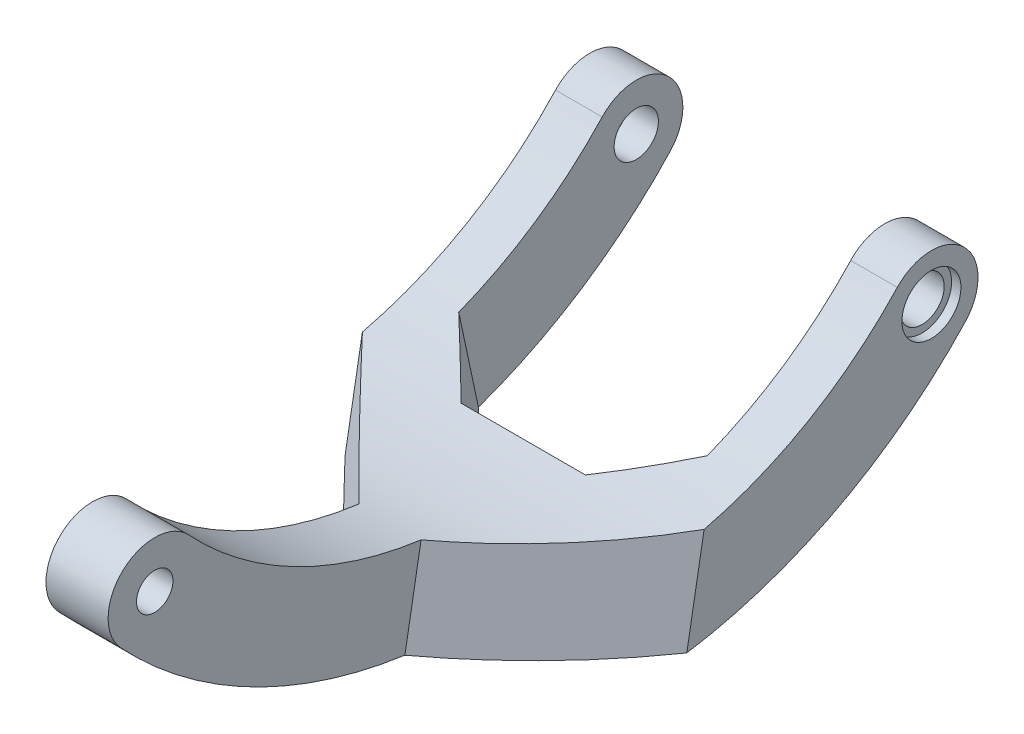
ISO-10303-21;
HEADER;
FILE_DESCRIPTION(('STEP AP214'),'2;1');
FILE_NAME('part.step','',(''),(''),'','','');
FILE_SCHEMA(('AUTOMOTIVE_DESIGN { 1 0 10303 214 1 1 1 1 }'));
ENDSEC;
DATA;
#1=APPLICATION_CONTEXT('core data for automotive mechanical design processes');
#2=APPLICATION_PROTOCOL_DEFINITION('international standard','automotive_design',2000,#1);
#3=PRODUCT_CONTEXT('',#1,'mechanical');
#4=PRODUCT('Part','Part','',(#3));
#5=PRODUCT_RELATED_PRODUCT_CATEGORY('part','',(#4));
#6=PRODUCT_DEFINITION_FORMATION('','',#4);
#7=PRODUCT_DEFINITION_CONTEXT('part definition',#1,'design');
#8=PRODUCT_DEFINITION('design','',#6,#7);
#9=PRODUCT_DEFINITION_SHAPE('','',#8);
#10=(LENGTH_UNIT() NAMED_UNIT(*) SI_UNIT(.MILLI.,.METRE.));
#11=(NAMED_UNIT(*) PLANE_ANGLE_UNIT() SI_UNIT($,.RADIAN.));
#12=(NAMED_UNIT(*) SI_UNIT($,.STERADIAN.) SOLID_ANGLE_UNIT());
#13=UNCERTAINTY_MEASURE_WITH_UNIT(LENGTH_MEASURE(1.E-05),#10,'distance_accuracy_value','');
#14=(GEOMETRIC_REPRESENTATION_CONTEXT(3) GLOBAL_UNCERTAINTY_ASSIGNED_CONTEXT((#13)) GLOBAL_UNIT_ASSIGNED_CONTEXT((#10,
#11,#12)) REPRESENTATION_CONTEXT('',''));
#15=CARTESIAN_POINT('',(0.,0.,0.));
#16=DIRECTION('',(0.,0.,1.));
#17=DIRECTION('',(1.,0.,0.));
#18=AXIS2_PLACEMENT_3D('',#15,#16,#17);
#19=CARTESIAN_POINT('',(11.,0.,-20.5));
#20=DIRECTION('',(-1.,0.,0.));
#21=DIRECTION('',(0.,0.,-1.));
#22=AXIS2_PLACEMENT_3D('',#19,#20,#21);
#23=CYLINDRICAL_SURFACE('',#22,1.425);
#24=CARTESIAN_POINT('',(-8.,0.,-20.5));
#25=DIRECTION('',(-1.,0.,0.));
#26=DIRECTION('',(0.,0.,1.));
#27=AXIS2_PLACEMENT_3D('',#24,#25,#26);
#28=CIRCLE('',#27,1.425);
#29=CARTESIAN_POINT('',(-8.,0.,-19.075));
#30=VERTEX_POINT('',#29);
#31=EDGE_CURVE('E292',#30,#30,#28,.F.);
#32=ORIENTED_EDGE('',*,*,#31,.T.);
#33=EDGE_LOOP('',(#32));
#34=FACE_BOUND('',#33,.T.);
#35=CARTESIAN_POINT('',(-10.,0.,-20.5));
#36=DIRECTION('',(1.,0.,0.));
#37=DIRECTION('',(0.,0.,-1.));
#38=AXIS2_PLACEMENT_3D('',#35,#36,#37);
#39=CIRCLE('',#38,1.425);
#40=CARTESIAN_POINT('',(-10.,0.,-21.925));
#41=VERTEX_POINT('',#40);
#42=EDGE_CURVE('E201',#41,#41,#39,.T.);
#43=ORIENTED_EDGE('',*,*,#42,.F.);
#44=EDGE_LOOP('',(#43));
#45=FACE_BOUND('',#44,.T.);
#46=ADVANCED_FACE('F45',(#34,#45),#23,.F.);
#47=CARTESIAN_POINT('',(11.,19.0722311227607,0.));
#48=DIRECTION('',(-1.,0.,0.));
#49=DIRECTION('',(0.,0.,-1.));
#50=AXIS2_PLACEMENT_3D('',#47,#48,#49);
#51=CYLINDRICAL_SURFACE('',#50,25.);
#52=CARTESIAN_POINT('',(-2.,19.0722311227607,0.));
#53=DIRECTION('',(-1.,0.,0.));
#54=DIRECTION('',(0.,0.,1.));
#55=AXIS2_PLACEMENT_3D('',#52,#53,#54);
#56=CIRCLE('',#55,25.);
#57=CARTESIAN_POINT('',(-2.,2.04345333458149,18.3035714285714));
#58=VERTEX_POINT('',#57);
#59=CARTESIAN_POINT('',(-2.,-5.70190684038016,3.35292233480958));
#60=VERTEX_POINT('',#59);
#61=EDGE_CURVE('E155',#58,#60,#56,.F.);
#62=ORIENTED_EDGE('',*,*,#61,.F.);
#63=DIRECTION('',(-1.,0.,0.));
#64=VECTOR('',#63,1.);
#65=CARTESIAN_POINT('',(11.,2.04345333458149,18.3035714285714));
#66=LINE('',#65,#64);
#67=CARTESIAN_POINT('',(2.,2.04345333458149,18.3035714285714));
#68=VERTEX_POINT('',#67);
#69=EDGE_CURVE('E151',#68,#58,#66,.T.);
#70=ORIENTED_EDGE('',*,*,#69,.F.);
#71=CARTESIAN_POINT('',(2.,19.0722311227607,0.));
#72=DIRECTION('',(-1.,0.,0.));
#73=DIRECTION('',(0.,0.,1.));
#74=AXIS2_PLACEMENT_3D('',#71,#72,#73);
#75=CIRCLE('',#74,25.);
#76=CARTESIAN_POINT('',(2.,-5.70190684038017,3.3529223348095));
#77=VERTEX_POINT('',#76);
#78=EDGE_CURVE('E315',#77,#68,#75,.T.);
#79=ORIENTED_EDGE('',*,*,#78,.F.);
#80=CARTESIAN_POINT('',(0.999999999999822,19.0722311227607,0.));
#81=DIRECTION('',(-0.707106781186544,-0.122787803968969,-0.696364240320023));
#82=DIRECTION('',(-0.707106781186551,0.122787803968968,0.696364240320016));
#83=AXIS2_PLACEMENT_3D('',#80,#81,#82);
#84=ELLIPSE('',#83,35.3553390593276,25.);
#85=CARTESIAN_POINT('',(11.,-5.22903101969769,-5.86929793787307));
#86=VERTEX_POINT('',#85);
#87=EDGE_CURVE('E211',#86,#77,#84,.T.);
#88=ORIENTED_EDGE('',*,*,#87,.F.);
#89=CARTESIAN_POINT('',(11.,19.0722311227607,0.));
#90=DIRECTION('',(-1.,0.,0.));
#91=DIRECTION('',(0.,0.,1.));
#92=AXIS2_PLACEMENT_3D('',#89,#90,#91);
#93=CIRCLE('',#92,25.);
#94=CARTESIAN_POINT('',(11.,2.0434533345815,-18.3035714285714));
#95=VERTEX_POINT('',#94);
#96=EDGE_CURVE('E257',#95,#86,#93,.T.);
#97=ORIENTED_EDGE('',*,*,#96,.F.);
#98=DIRECTION('',(-1.,0.,0.));
#99=VECTOR('',#98,1.);
#100=CARTESIAN_POINT('',(11.,2.0434533345815,-18.3035714285714));
#101=LINE('',#100,#99);
#102=CARTESIAN_POINT('',(8.,2.0434533345815,-18.3035714285714));
#103=VERTEX_POINT('',#102);
#104=EDGE_CURVE('E183',#95,#103,#101,.T.);
#105=ORIENTED_EDGE('',*,*,#104,.T.);
#106=CARTESIAN_POINT('',(8.,19.0722311227607,0.));
#107=DIRECTION('',(-1.,0.,0.));
#108=DIRECTION('',(0.,0.,1.));
#109=AXIS2_PLACEMENT_3D('',#106,#107,#108);
#110=CIRCLE('',#109,25.);
#111=CARTESIAN_POINT('',(8.,-4.22428912871639,-9.07039933919781));
#112=VERTEX_POINT('',#111);
#113=EDGE_CURVE('E239',#103,#112,#110,.T.);
#114=ORIENTED_EDGE('',*,*,#113,.T.);
#115=CARTESIAN_POINT('',(3.99999999999997,19.0722311227607,0.));
#116=DIRECTION('',(-0.707106781186544,0.147816494294591,-0.691484116964708));
#117=DIRECTION('',(-0.707106781186551,-0.147816494294589,0.691484116964701));
#118=AXIS2_PLACEMENT_3D('',#115,#116,#117);
#119=ELLIPSE('',#118,35.3553390593276,25.);
#120=CARTESIAN_POINT('',(3.99999999999997,-5.37542428666607,-5.22610227434636));
#121=VERTEX_POINT('',#120);
#122=EDGE_CURVE('E53',#121,#112,#119,.F.);
#123=ORIENTED_EDGE('',*,*,#122,.F.);
#124=DIRECTION('',(-1.,0.,0.));
#125=VECTOR('',#124,1.);
#126=CARTESIAN_POINT('',(34.168824834572,-5.37542428666607,-5.22610227434636));
#127=LINE('',#126,#125);
#128=CARTESIAN_POINT('',(-3.99999999999997,-5.37542428666607,-5.22610227434636));
#129=VERTEX_POINT('',#128);
#130=EDGE_CURVE('E243',#121,#129,#127,.T.);
#131=ORIENTED_EDGE('',*,*,#130,.T.);
#132=CARTESIAN_POINT('',(-3.99999999999997,19.0722311227607,0.));
#133=DIRECTION('',(-0.707106781186544,-0.147816494294591,0.691484116964709));
#134=DIRECTION('',(-0.707106781186551,0.147816494294589,-0.691484116964701));
#135=AXIS2_PLACEMENT_3D('',#132,#133,#134);
#136=ELLIPSE('',#135,35.3553390593276,25.);
#137=CARTESIAN_POINT('',(-8.,-4.22428912871639,-9.07039933919781));
#138=VERTEX_POINT('',#137);
#139=EDGE_CURVE('E232',#138,#129,#136,.T.);
#140=ORIENTED_EDGE('',*,*,#139,.F.);
#141=CARTESIAN_POINT('',(-8.,19.0722311227607,0.));
#142=DIRECTION('',(-1.,0.,0.));
#143=DIRECTION('',(0.,0.,1.));
#144=AXIS2_PLACEMENT_3D('',#141,#142,#143);
#145=CIRCLE('',#144,25.);
#146=CARTESIAN_POINT('',(-8.,2.0434533345815,-18.3035714285714));
#147=VERTEX_POINT('',#146);
#148=EDGE_CURVE('E284',#138,#147,#145,.F.);
#149=ORIENTED_EDGE('',*,*,#148,.T.);
#150=CARTESIAN_POINT('',(-11.,2.0434533345815,-18.3035714285714));
#151=VERTEX_POINT('',#150);
#152=EDGE_CURVE('E182',#147,#151,#101,.T.);
#153=ORIENTED_EDGE('',*,*,#152,.T.);
#154=CARTESIAN_POINT('',(-11.,19.0722311227607,0.));
#155=DIRECTION('',(-1.,0.,0.));
#156=DIRECTION('',(0.,0.,1.));
#157=AXIS2_PLACEMENT_3D('',#154,#155,#156);
#158=CIRCLE('',#157,25.);
#159=CARTESIAN_POINT('',(-11.,-5.22903101969766,-5.86929793787319));
#160=VERTEX_POINT('',#159);
#161=EDGE_CURVE('E265',#151,#160,#158,.T.);
#162=ORIENTED_EDGE('',*,*,#161,.T.);
#163=CARTESIAN_POINT('',(-0.999999999999926,19.0722311227607,0.));
#164=DIRECTION('',(0.707106781186551,-0.122787803968968,-0.696364240320016));
#165=DIRECTION('',(-0.707106781186544,-0.122787803968969,-0.696364240320023));
#166=AXIS2_PLACEMENT_3D('',#163,#164,#165);
#167=ELLIPSE('',#166,35.3553390593272,25.);
#168=EDGE_CURVE('E214',#60,#160,#167,.T.);
#169=ORIENTED_EDGE('',*,*,#168,.F.);
#170=EDGE_LOOP('',(#62,#70,#79,#88,#97,#105,#114,#123,#131,#140,#149,#153,#162,#169));
#171=FACE_BOUND('',#170,.T.);
#172=ADVANCED_FACE('F240',(#171),#51,.F.);
#173=CARTESIAN_POINT('',(11.,19.0722311227607,0.));
#174=DIRECTION('',(-1.,0.,0.));
#175=DIRECTION('',(0.,0.,-1.));
#176=AXIS2_PLACEMENT_3D('',#173,#174,#175);
#177=CYLINDRICAL_SURFACE('',#176,31.);
#178=CARTESIAN_POINT('',(-0.999999999999926,19.0722311227607,0.));
#179=DIRECTION('',(0.707106781186551,-0.122787803968968,-0.696364240320016));
#180=DIRECTION('',(-0.707106781186544,-0.122787803968969,-0.696364240320023));
#181=AXIS2_PLACEMENT_3D('',#178,#179,#180);
#182=ELLIPSE('',#181,43.8406204335657,31.);
#183=CARTESIAN_POINT('',(-11.,-11.5612690684152,-4.75275352161561));
#184=VERTEX_POINT('',#183);
#185=CARTESIAN_POINT('',(-2.,-11.6145692679641,4.39548424861381));
#186=VERTEX_POINT('',#185);
#187=EDGE_CURVE('E209',#184,#186,#182,.F.);
#188=ORIENTED_EDGE('',*,*,#187,.F.);
#189=CARTESIAN_POINT('',(-11.,19.0722311227607,0.));
#190=DIRECTION('',(-1.,0.,0.));
#191=DIRECTION('',(0.,0.,1.));
#192=AXIS2_PLACEMENT_3D('',#189,#190,#191);
#193=CIRCLE('',#192,31.);
#194=CARTESIAN_POINT('',(-11.,-2.04345333458148,-22.6964285714286));
#195=VERTEX_POINT('',#194);
#196=EDGE_CURVE('E261',#195,#184,#193,.T.);
#197=ORIENTED_EDGE('',*,*,#196,.F.);
#198=DIRECTION('',(-1.,0.,0.));
#199=VECTOR('',#198,1.);
#200=CARTESIAN_POINT('',(11.,-2.04345333458148,-22.6964285714286));
#201=LINE('',#200,#199);
#202=CARTESIAN_POINT('',(-8.,-2.04345333458148,-22.6964285714286));
#203=VERTEX_POINT('',#202);
#204=EDGE_CURVE('E172',#203,#195,#201,.T.);
#205=ORIENTED_EDGE('',*,*,#204,.F.);
#206=CARTESIAN_POINT('',(-8.,19.0722311227607,0.));
#207=DIRECTION('',(-1.,0.,0.));
#208=DIRECTION('',(0.,0.,1.));
#209=AXIS2_PLACEMENT_3D('',#206,#207,#208);
#210=CIRCLE('',#209,31.);
#211=CARTESIAN_POINT('',(-8.,-10.1532630721689,-10.3378183898799));
#212=VERTEX_POINT('',#211);
#213=EDGE_CURVE('E248',#212,#203,#210,.F.);
#214=ORIENTED_EDGE('',*,*,#213,.F.);
#215=CARTESIAN_POINT('',(-3.99999999999997,19.0722311227607,0.));
#216=DIRECTION('',(-0.707106781186544,-0.147816494294591,0.691484116964709));
#217=DIRECTION('',(-0.707106781186551,0.147816494294589,-0.691484116964701));
#218=AXIS2_PLACEMENT_3D('',#215,#216,#217);
#219=ELLIPSE('',#218,43.8406204335662,31.);
#220=CARTESIAN_POINT('',(-3.99999999999997,-11.2428615849285,-6.48036682018948));
#221=VERTEX_POINT('',#220);
#222=EDGE_CURVE('E229',#221,#212,#219,.F.);
#223=ORIENTED_EDGE('',*,*,#222,.F.);
#224=DIRECTION('',(-1.,0.,0.));
#225=VECTOR('',#224,1.);
#226=CARTESIAN_POINT('',(34.168824834572,-11.2428615849285,-6.48036682018948));
#227=LINE('',#226,#225);
#228=CARTESIAN_POINT('',(3.99999999999997,-11.2428615849285,-6.48036682018948));
#229=VERTEX_POINT('',#228);
#230=EDGE_CURVE('E254',#229,#221,#227,.T.);
#231=ORIENTED_EDGE('',*,*,#230,.F.);
#232=CARTESIAN_POINT('',(3.99999999999997,19.0722311227607,0.));
#233=DIRECTION('',(-0.707106781186544,0.147816494294591,-0.691484116964708));
#234=DIRECTION('',(-0.707106781186551,-0.147816494294589,0.691484116964701));
#235=AXIS2_PLACEMENT_3D('',#232,#233,#234);
#236=ELLIPSE('',#235,43.8406204335662,31.);
#237=CARTESIAN_POINT('',(8.,-10.1532630721689,-10.3378183898799));
#238=VERTEX_POINT('',#237);
#239=EDGE_CURVE('E12',#238,#229,#236,.T.);
#240=ORIENTED_EDGE('',*,*,#239,.F.);
#241=CARTESIAN_POINT('',(8.,19.0722311227607,0.));
#242=DIRECTION('',(-1.,0.,0.));
#243=DIRECTION('',(0.,0.,1.));
#244=AXIS2_PLACEMENT_3D('',#241,#242,#243);
#245=CIRCLE('',#244,31.);
#246=CARTESIAN_POINT('',(8.,-2.04345333458148,-22.6964285714286));
#247=VERTEX_POINT('',#246);
#248=EDGE_CURVE('E269',#247,#238,#245,.T.);
#249=ORIENTED_EDGE('',*,*,#248,.F.);
#250=CARTESIAN_POINT('',(11.,-2.04345333458148,-22.6964285714286));
#251=VERTEX_POINT('',#250);
#252=EDGE_CURVE('E175',#251,#247,#201,.T.);
#253=ORIENTED_EDGE('',*,*,#252,.F.);
#254=CARTESIAN_POINT('',(11.,19.0722311227607,0.));
#255=DIRECTION('',(-1.,0.,0.));
#256=DIRECTION('',(0.,0.,1.));
#257=AXIS2_PLACEMENT_3D('',#254,#255,#256);
#258=CIRCLE('',#257,31.);
#259=CARTESIAN_POINT('',(11.,-11.5612690684152,-4.7527535216155));
#260=VERTEX_POINT('',#259);
#261=EDGE_CURVE('E177',#251,#260,#258,.T.);
#262=ORIENTED_EDGE('',*,*,#261,.T.);
#263=CARTESIAN_POINT('',(0.999999999999822,19.0722311227607,0.));
#264=DIRECTION('',(-0.707106781186544,-0.122787803968969,-0.696364240320023));
#265=DIRECTION('',(-0.707106781186551,0.122787803968968,0.696364240320016));
#266=AXIS2_PLACEMENT_3D('',#263,#264,#265);
#267=ELLIPSE('',#266,43.8406204335662,31.);
#268=CARTESIAN_POINT('',(2.,-11.6145692679642,4.39548424861372));
#269=VERTEX_POINT('',#268);
#270=EDGE_CURVE('E206',#269,#260,#267,.F.);
#271=ORIENTED_EDGE('',*,*,#270,.F.);
#272=CARTESIAN_POINT('',(2.,19.0722311227607,0.));
#273=DIRECTION('',(-1.,0.,0.));
#274=DIRECTION('',(0.,0.,1.));
#275=AXIS2_PLACEMENT_3D('',#272,#273,#274);
#276=CIRCLE('',#275,31.);
#277=CARTESIAN_POINT('',(2.,-2.0434533345815,22.6964285714286));
#278=VERTEX_POINT('',#277);
#279=EDGE_CURVE('E171',#278,#269,#276,.F.);
#280=ORIENTED_EDGE('',*,*,#279,.F.);
#281=DIRECTION('',(-1.,0.,0.));
#282=VECTOR('',#281,1.);
#283=CARTESIAN_POINT('',(11.,-2.0434533345815,22.6964285714286));
#284=LINE('',#283,#282);
#285=CARTESIAN_POINT('',(-2.,-2.0434533345815,22.6964285714286));
#286=VERTEX_POINT('',#285);
#287=EDGE_CURVE('E148',#278,#286,#284,.T.);
#288=ORIENTED_EDGE('',*,*,#287,.T.);
#289=CARTESIAN_POINT('',(-2.,19.0722311227607,0.));
#290=DIRECTION('',(-1.,0.,0.));
#291=DIRECTION('',(0.,0.,1.));
#292=AXIS2_PLACEMENT_3D('',#289,#290,#291);
#293=CIRCLE('',#292,31.);
#294=EDGE_CURVE('E159',#186,#286,#293,.T.);
#295=ORIENTED_EDGE('',*,*,#294,.F.);
#296=EDGE_LOOP('',(#188,#197,#205,#214,#223,#231,#240,#249,#253,#262,#271,#280,#288,#295));
#297=FACE_BOUND('',#296,.T.);
#298=ADVANCED_FACE('F168',(#297),#177,.T.);
#299=CARTESIAN_POINT('',(-11.,0.,0.));
#300=DIRECTION('',(1.,0.,0.));
#301=DIRECTION('',(0.,0.,1.));
#302=AXIS2_PLACEMENT_3D('',#299,#300,#301);
#303=PLANE('',#302);
#304=CARTESIAN_POINT('',(-11.,0.,-20.5));
#305=DIRECTION('',(-1.,0.,0.));
#306=DIRECTION('',(0.,0.,1.));
#307=AXIS2_PLACEMENT_3D('',#304,#305,#306);
#308=CIRCLE('',#307,1.9);
#309=CARTESIAN_POINT('',(-11.,0.,-18.6));
#310=VERTEX_POINT('',#309);
#311=EDGE_CURVE('E156',#310,#310,#308,.T.);
#312=ORIENTED_EDGE('',*,*,#311,.F.);
#313=EDGE_LOOP('',(#312));
#314=FACE_BOUND('',#313,.T.);
#315=ORIENTED_EDGE('',*,*,#161,.F.);
#316=CARTESIAN_POINT('',(-11.,0.,-20.5));
#317=DIRECTION('',(-1.,0.,0.));
#318=DIRECTION('',(0.,0.,1.));
#319=AXIS2_PLACEMENT_3D('',#316,#317,#318);
#320=CIRCLE('',#319,3.);
#321=EDGE_CURVE('E268',#151,#195,#320,.T.);
#322=ORIENTED_EDGE('',*,*,#321,.T.);
#323=ORIENTED_EDGE('',*,*,#196,.T.);
#324=DIRECTION('',(0.,-0.984807753012209,0.173648177666924));
#325=VECTOR('',#324,1.);
#326=CARTESIAN_POINT('',(-11.,-13.1932909972871,-4.46498402244763));
#327=LINE('',#326,#325);
#328=EDGE_CURVE('E186',#160,#184,#327,.T.);
#329=ORIENTED_EDGE('',*,*,#328,.F.);
#330=EDGE_LOOP('',(#315,#322,#323,#329));
#331=FACE_BOUND('',#330,.T.);
#332=ADVANCED_FACE('F274',(#314,#331),#303,.F.);
#333=CARTESIAN_POINT('',(8.,0.,-20.5));
#334=DIRECTION('',(-1.,0.,0.));
#335=DIRECTION('',(0.,0.,1.));
#336=AXIS2_PLACEMENT_3D('',#333,#334,#335);
#337=CIRCLE('',#336,1.425);
#338=CARTESIAN_POINT('',(8.,0.,-19.075));
#339=VERTEX_POINT('',#338);
#340=EDGE_CURVE('E246',#339,#339,#337,.T.);
#341=ORIENTED_EDGE('',*,*,#340,.T.);
#342=EDGE_LOOP('',(#341));
#343=FACE_BOUND('',#342,.T.);
#344=CARTESIAN_POINT('',(10.4,0.,-20.5));
#345=DIRECTION('',(-1.,0.,0.));
#346=DIRECTION('',(0.,0.,1.));
#347=AXIS2_PLACEMENT_3D('',#344,#345,#346);
#348=CIRCLE('',#347,1.425);
#349=CARTESIAN_POINT('',(10.4,0.,-19.075));
#350=VERTEX_POINT('',#349);
#351=EDGE_CURVE('E190',#350,#350,#348,.T.);
#352=ORIENTED_EDGE('',*,*,#351,.F.);
#353=EDGE_LOOP('',(#352));
#354=FACE_BOUND('',#353,.T.);
#355=ADVANCED_FACE('F350',(#343,#354),#23,.F.);
#356=CARTESIAN_POINT('',(11.,0.,20.5));
#357=DIRECTION('',(-1.,0.,0.));
#358=DIRECTION('',(0.,0.,-1.));
#359=AXIS2_PLACEMENT_3D('',#356,#357,#358);
#360=CYLINDRICAL_SURFACE('',#359,3.);
#361=ORIENTED_EDGE('',*,*,#287,.F.);
#362=CARTESIAN_POINT('',(2.,0.,20.5));
#363=DIRECTION('',(-1.,0.,0.));
#364=DIRECTION('',(0.,0.,1.));
#365=AXIS2_PLACEMENT_3D('',#362,#363,#364);
#366=CIRCLE('',#365,3.);
#367=EDGE_CURVE('E312',#68,#278,#366,.F.);
#368=ORIENTED_EDGE('',*,*,#367,.F.);
#369=ORIENTED_EDGE('',*,*,#69,.T.);
#370=CARTESIAN_POINT('',(-2.,0.,20.5));
#371=DIRECTION('',(-1.,0.,0.));
#372=DIRECTION('',(0.,0.,1.));
#373=AXIS2_PLACEMENT_3D('',#370,#371,#372);
#374=CIRCLE('',#373,3.);
#375=EDGE_CURVE('E144',#286,#58,#374,.T.);
#376=ORIENTED_EDGE('',*,*,#375,.F.);
#377=EDGE_LOOP('',(#361,#368,#369,#376));
#378=FACE_BOUND('',#377,.T.);
#379=ADVANCED_FACE('F146',(#378),#360,.T.);
#380=CARTESIAN_POINT('',(11.,0.,20.5));
#381=DIRECTION('',(-1.,0.,0.));
#382=DIRECTION('',(0.,0.,-1.));
#383=AXIS2_PLACEMENT_3D('',#380,#381,#382);
#384=CYLINDRICAL_SURFACE('',#383,1.175);
#385=CARTESIAN_POINT('',(-2.,0.,20.5));
#386=DIRECTION('',(-1.,0.,0.));
#387=DIRECTION('',(0.,0.,1.));
#388=AXIS2_PLACEMENT_3D('',#385,#386,#387);
#389=CIRCLE('',#388,1.175);
#390=CARTESIAN_POINT('',(-2.,0.,21.675));
#391=VERTEX_POINT('',#390);
#392=EDGE_CURVE('E166',#391,#391,#389,.F.);
#393=ORIENTED_EDGE('',*,*,#392,.F.);
#394=EDGE_LOOP('',(#393));
#395=FACE_BOUND('',#394,.T.);
#396=CARTESIAN_POINT('',(2.,0.,20.5));
#397=DIRECTION('',(-1.,0.,0.));
#398=DIRECTION('',(0.,0.,1.));
#399=AXIS2_PLACEMENT_3D('',#396,#397,#398);
#400=CIRCLE('',#399,1.175);
#401=CARTESIAN_POINT('',(2.,0.,21.675));
#402=VERTEX_POINT('',#401);
#403=EDGE_CURVE('E194',#402,#402,#400,.T.);
#404=ORIENTED_EDGE('',*,*,#403,.F.);
#405=EDGE_LOOP('',(#404));
#406=FACE_BOUND('',#405,.T.);
#407=ADVANCED_FACE('F362',(#395,#406),#384,.F.);
#408=CARTESIAN_POINT('',(11.,0.,-20.5));
#409=DIRECTION('',(-1.,0.,0.));
#410=DIRECTION('',(0.,0.,-1.));
#411=AXIS2_PLACEMENT_3D('',#408,#409,#410);
#412=CYLINDRICAL_SURFACE('',#411,3.);
#413=CARTESIAN_POINT('',(-8.,0.,-20.5));
#414=DIRECTION('',(-1.,0.,0.));
#415=DIRECTION('',(0.,0.,1.));
#416=AXIS2_PLACEMENT_3D('',#413,#414,#415);
#417=CIRCLE('',#416,3.);
#418=EDGE_CURVE('E244',#203,#147,#417,.F.);
#419=ORIENTED_EDGE('',*,*,#418,.F.);
#420=ORIENTED_EDGE('',*,*,#204,.T.);
#421=ORIENTED_EDGE('',*,*,#321,.F.);
#422=ORIENTED_EDGE('',*,*,#152,.F.);
#423=EDGE_LOOP('',(#419,#420,#421,#422));
#424=FACE_BOUND('',#423,.T.);
#425=ADVANCED_FACE('F286',(#424),#412,.T.);
#426=ORIENTED_EDGE('',*,*,#104,.F.);
#427=CARTESIAN_POINT('',(11.,0.,-20.5));
#428=DIRECTION('',(-1.,0.,0.));
#429=DIRECTION('',(0.,0.,1.));
#430=AXIS2_PLACEMENT_3D('',#427,#428,#429);
#431=CIRCLE('',#430,3.);
#432=EDGE_CURVE('E260',#95,#251,#431,.T.);
#433=ORIENTED_EDGE('',*,*,#432,.T.);
#434=ORIENTED_EDGE('',*,*,#252,.T.);
#435=CARTESIAN_POINT('',(8.,0.,-20.5));
#436=DIRECTION('',(-1.,0.,0.));
#437=DIRECTION('',(0.,0.,1.));
#438=AXIS2_PLACEMENT_3D('',#435,#436,#437);
#439=CIRCLE('',#438,3.);
#440=EDGE_CURVE('E252',#103,#247,#439,.T.);
#441=ORIENTED_EDGE('',*,*,#440,.F.);
#442=EDGE_LOOP('',(#426,#433,#434,#441));
#443=FACE_BOUND('',#442,.T.);
#444=ADVANCED_FACE('F304',(#443),#412,.T.);
#445=CARTESIAN_POINT('',(11.,0.,0.));
#446=DIRECTION('',(1.,0.,0.));
#447=DIRECTION('',(0.,0.,1.));
#448=AXIS2_PLACEMENT_3D('',#445,#446,#447);
#449=PLANE('',#448);
#450=CARTESIAN_POINT('',(11.,0.,-20.5));
#451=DIRECTION('',(-1.,0.,0.));
#452=DIRECTION('',(0.,0.,1.));
#453=AXIS2_PLACEMENT_3D('',#450,#451,#452);
#454=CIRCLE('',#453,1.9);
#455=CARTESIAN_POINT('',(11.,0.,-22.4));
#456=VERTEX_POINT('',#455);
#457=EDGE_CURVE('E187',#456,#456,#454,.F.);
#458=ORIENTED_EDGE('',*,*,#457,.F.);
#459=EDGE_LOOP('',(#458));
#460=FACE_BOUND('',#459,.T.);
#461=ORIENTED_EDGE('',*,*,#261,.F.);
#462=ORIENTED_EDGE('',*,*,#432,.F.);
#463=ORIENTED_EDGE('',*,*,#96,.T.);
#464=DIRECTION('',(0.,0.984807753012209,-0.173648177666924));
#465=VECTOR('',#464,1.);
#466=CARTESIAN_POINT('',(11.,-7.28444447921383,-5.50687308844907));
#467=LINE('',#466,#465);
#468=EDGE_CURVE('E217',#260,#86,#467,.T.);
#469=ORIENTED_EDGE('',*,*,#468,.F.);
#470=EDGE_LOOP('',(#461,#462,#463,#469));
#471=FACE_BOUND('',#470,.T.);
#472=ADVANCED_FACE('F392',(#460,#471),#449,.T.);
#473=CARTESIAN_POINT('',(34.168824834572,0.83344566648589,-3.89885068969024));
#474=DIRECTION('',(0.,0.209044090973854,-0.977906216377069));
#475=DIRECTION('',(0.,-0.977906216377069,-0.209044090973854));
#476=AXIS2_PLACEMENT_3D('',#473,#474,#475);
#477=PLANE('',#476);
#478=ORIENTED_EDGE('',*,*,#130,.F.);
#479=DIRECTION('',(0.,0.977906216377069,0.209044090973854));
#480=VECTOR('',#479,1.);
#481=CARTESIAN_POINT('',(3.99999999999997,0.83344566648589,-3.89885068969024));
#482=LINE('',#481,#480);
#483=EDGE_CURVE('E222',#229,#121,#482,.T.);
#484=ORIENTED_EDGE('',*,*,#483,.F.);
#485=ORIENTED_EDGE('',*,*,#230,.T.);
#486=DIRECTION('',(0.,-0.977906216377069,-0.209044090973854));
#487=VECTOR('',#486,1.);
#488=CARTESIAN_POINT('',(-3.99999999999997,-11.2428615849285,-6.48036682018948));
#489=LINE('',#488,#487);
#490=EDGE_CURVE('E224',#129,#221,#489,.T.);
#491=ORIENTED_EDGE('',*,*,#490,.F.);
#492=EDGE_LOOP('',(#478,#484,#485,#491));
#493=FACE_BOUND('',#492,.T.);
#494=ADVANCED_FACE('F307',(#493),#477,.T.);
#495=CARTESIAN_POINT('',(8.,0.,0.));
#496=DIRECTION('',(1.,0.,0.));
#497=DIRECTION('',(0.,0.,1.));
#498=AXIS2_PLACEMENT_3D('',#495,#496,#497);
#499=PLANE('',#498);
#500=ORIENTED_EDGE('',*,*,#340,.F.);
#501=EDGE_LOOP('',(#500));
#502=FACE_BOUND('',#501,.T.);
#503=ORIENTED_EDGE('',*,*,#113,.F.);
#504=ORIENTED_EDGE('',*,*,#440,.T.);
#505=ORIENTED_EDGE('',*,*,#248,.T.);
#506=DIRECTION('',(0.,-0.977906216377069,-0.209044090973854));
#507=VECTOR('',#506,1.);
#508=CARTESIAN_POINT('',(8.,1.66962203038131,-7.81047555519851));
#509=LINE('',#508,#507);
#510=EDGE_CURVE('E59',#112,#238,#509,.T.);
#511=ORIENTED_EDGE('',*,*,#510,.F.);
#512=EDGE_LOOP('',(#503,#504,#505,#511));
#513=FACE_BOUND('',#512,.T.);
#514=ADVANCED_FACE('F301',(#502,#513),#499,.F.);
#515=CARTESIAN_POINT('',(-8.,0.,0.));
#516=DIRECTION('',(1.,0.,0.));
#517=DIRECTION('',(0.,0.,1.));
#518=AXIS2_PLACEMENT_3D('',#515,#516,#517);
#519=PLANE('',#518);
#520=ORIENTED_EDGE('',*,*,#213,.T.);
#521=ORIENTED_EDGE('',*,*,#418,.T.);
#522=ORIENTED_EDGE('',*,*,#148,.F.);
#523=DIRECTION('',(0.,0.977906216377069,0.209044090973854));
#524=VECTOR('',#523,1.);
#525=CARTESIAN_POINT('',(-8.,-4.53924792277066,-9.13772713985462));
#526=LINE('',#525,#524);
#527=EDGE_CURVE('E226',#212,#138,#526,.T.);
#528=ORIENTED_EDGE('',*,*,#527,.F.);
#529=EDGE_LOOP('',(#520,#521,#522,#528));
#530=FACE_BOUND('',#529,.T.);
#531=ORIENTED_EDGE('',*,*,#31,.F.);
#532=EDGE_LOOP('',(#531));
#533=FACE_BOUND('',#532,.T.);
#534=ADVANCED_FACE('F310',(#530,#533),#519,.T.);
#535=CARTESIAN_POINT('',(2.,0.,0.));
#536=DIRECTION('',(1.,0.,0.));
#537=DIRECTION('',(0.,0.,1.));
#538=AXIS2_PLACEMENT_3D('',#535,#536,#537);
#539=PLANE('',#538);
#540=ORIENTED_EDGE('',*,*,#403,.T.);
#541=EDGE_LOOP('',(#540));
#542=FACE_BOUND('',#541,.T.);
#543=ORIENTED_EDGE('',*,*,#78,.T.);
#544=ORIENTED_EDGE('',*,*,#367,.T.);
#545=ORIENTED_EDGE('',*,*,#279,.T.);
#546=DIRECTION('',(0.,-0.984807753012209,0.173648177666924));
#547=VECTOR('',#546,1.);
#548=CARTESIAN_POINT('',(2.,0.401449959722567,2.27673585806095));
#549=LINE('',#548,#547);
#550=EDGE_CURVE('E220',#77,#269,#549,.T.);
#551=ORIENTED_EDGE('',*,*,#550,.F.);
#552=EDGE_LOOP('',(#543,#544,#545,#551));
#553=FACE_BOUND('',#552,.T.);
#554=ADVANCED_FACE('F378',(#542,#553),#539,.T.);
#555=CARTESIAN_POINT('',(11.000012,0.,-20.5));
#556=DIRECTION('',(-1.,0.,0.));
#557=DIRECTION('',(0.,0.,-1.));
#558=AXIS2_PLACEMENT_3D('',#555,#556,#557);
#559=CYLINDRICAL_SURFACE('',#558,1.9);
#560=CARTESIAN_POINT('',(10.4,0.,-20.5));
#561=DIRECTION('',(-1.,0.,0.));
#562=DIRECTION('',(0.,0.,1.));
#563=AXIS2_PLACEMENT_3D('',#560,#561,#562);
#564=CIRCLE('',#563,1.9);
#565=CARTESIAN_POINT('',(10.4,0.,-22.4));
#566=VERTEX_POINT('',#565);
#567=EDGE_CURVE('E191',#566,#566,#564,.T.);
#568=CARTESIAN_POINT('',(11.,0.,-22.4));
#569=CARTESIAN_POINT('',(10.99375,0.,-22.4));
#570=CARTESIAN_POINT('',(10.9875,0.,-22.4));
#571=CARTESIAN_POINT('',(10.975,0.,-22.4));
#572=CARTESIAN_POINT('',(10.96875,0.,-22.4));
#573=CARTESIAN_POINT('',(10.95625,0.,-22.4));
#574=CARTESIAN_POINT('',(10.95,0.,-22.4));
#575=CARTESIAN_POINT('',(10.9375,0.,-22.4));
#576=CARTESIAN_POINT('',(10.93125,0.,-22.4));
#577=CARTESIAN_POINT('',(10.91875,0.,-22.4));
#578=CARTESIAN_POINT('',(10.9125,0.,-22.4));
#579=CARTESIAN_POINT('',(10.9,0.,-22.4));
#580=CARTESIAN_POINT('',(10.89375,0.,-22.4));
#581=CARTESIAN_POINT('',(10.88125,0.,-22.4));
#582=CARTESIAN_POINT('',(10.875,0.,-22.4));
#583=CARTESIAN_POINT('',(10.8625,0.,-22.4));
#584=CARTESIAN_POINT('',(10.85625,0.,-22.4));
#585=CARTESIAN_POINT('',(10.84375,0.,-22.4));
#586=CARTESIAN_POINT('',(10.8375,0.,-22.4));
#587=CARTESIAN_POINT('',(10.825,0.,-22.4));
#588=CARTESIAN_POINT('',(10.81875,0.,-22.4));
#589=CARTESIAN_POINT('',(10.80625,0.,-22.4));
#590=CARTESIAN_POINT('',(10.8,0.,-22.4));
#591=CARTESIAN_POINT('',(10.7875,0.,-22.4));
#592=CARTESIAN_POINT('',(10.78125,0.,-22.4));
#593=CARTESIAN_POINT('',(10.76875,0.,-22.4));
#594=CARTESIAN_POINT('',(10.7625,0.,-22.4));
#595=CARTESIAN_POINT('',(10.75,0.,-22.4));
#596=CARTESIAN_POINT('',(10.74375,0.,-22.4));
#597=CARTESIAN_POINT('',(10.73125,0.,-22.4));
#598=CARTESIAN_POINT('',(10.725,0.,-22.4));
#599=CARTESIAN_POINT('',(10.7125,0.,-22.4));
#600=CARTESIAN_POINT('',(10.70625,0.,-22.4));
#601=CARTESIAN_POINT('',(10.69375,0.,-22.4));
#602=CARTESIAN_POINT('',(10.6875,0.,-22.4));
#603=CARTESIAN_POINT('',(10.675,0.,-22.4));
#604=CARTESIAN_POINT('',(10.66875,0.,-22.4));
#605=CARTESIAN_POINT('',(10.65625,0.,-22.4));
#606=CARTESIAN_POINT('',(10.65,0.,-22.4));
#607=CARTESIAN_POINT('',(10.6375,0.,-22.4));
#608=CARTESIAN_POINT('',(10.63125,0.,-22.4));
#609=CARTESIAN_POINT('',(10.61875,0.,-22.4));
#610=CARTESIAN_POINT('',(10.6125,0.,-22.4));
#611=CARTESIAN_POINT('',(10.6,0.,-22.4));
#612=CARTESIAN_POINT('',(10.59375,0.,-22.4));
#613=CARTESIAN_POINT('',(10.58125,0.,-22.4));
#614=CARTESIAN_POINT('',(10.575,0.,-22.4));
#615=CARTESIAN_POINT('',(10.5625,0.,-22.4));
#616=CARTESIAN_POINT('',(10.55625,0.,-22.4));
#617=CARTESIAN_POINT('',(10.54375,0.,-22.4));
#618=CARTESIAN_POINT('',(10.5375,0.,-22.4));
#619=CARTESIAN_POINT('',(10.525,0.,-22.4));
#620=CARTESIAN_POINT('',(10.51875,0.,-22.4));
#621=CARTESIAN_POINT('',(10.50625,0.,-22.4));
#622=CARTESIAN_POINT('',(10.5,0.,-22.4));
#623=CARTESIAN_POINT('',(10.4875,0.,-22.4));
#624=CARTESIAN_POINT('',(10.48125,0.,-22.4));
#625=CARTESIAN_POINT('',(10.46875,0.,-22.4));
#626=CARTESIAN_POINT('',(10.4625,0.,-22.4));
#627=CARTESIAN_POINT('',(10.45,0.,-22.4));
#628=CARTESIAN_POINT('',(10.44375,0.,-22.4));
#629=CARTESIAN_POINT('',(10.43125,0.,-22.4));
#630=CARTESIAN_POINT('',(10.425,0.,-22.4));
#631=CARTESIAN_POINT('',(10.4125,0.,-22.4));
#632=CARTESIAN_POINT('',(10.40625,0.,-22.4));
#633=CARTESIAN_POINT('',(10.4,0.,-22.4));
#634=B_SPLINE_CURVE_WITH_KNOTS('',3,(#568,#569,#570,#571,#572,#573,#574,#575,#576,#577,#578,
#579,#580,#581,#582,#583,#584,#585,#586,#587,#588,#589,#590,#591,#592,#593,#594,#595,#596,#597,
#598,#599,#600,#601,#602,#603,#604,#605,#606,#607,#608,#609,#610,#611,#612,#613,#614,#615,#616,
#617,#618,#619,#620,#621,#622,#623,#624,#625,#626,#627,#628,#629,#630,#631,#632,#633),
.UNSPECIFIED.,.F.,.F.,(4,2,2,2,2,2,2,2,2,2,2,2,2,2,2,2,2,2,2,2,2,2,2,2,2,2,2,2,2,2,2,2,4),(0.,
0.0187500000000014,0.0375000000000011,0.0562500000000007,0.0750000000000004,0.0937500000000001,
0.112500000000001,0.131250000000001,0.150000000000001,0.168750000000001,0.1875,
0.206250000000002,0.225000000000001,0.243750000000001,0.262500000000001,0.28125,0.3,
0.318750000000001,0.337500000000001,0.356250000000001,0.375,0.39375,0.412500000000001,
0.431250000000001,0.450000000000001,0.46875,0.4875,0.506250000000002,0.525000000000001,
0.543750000000001,0.5625,0.58125,0.6),.UNSPECIFIED.);
#635=EDGE_CURVE('BSEAM373',#456,#566,#634,.T.);
#636=ORIENTED_EDGE('',*,*,#457,.T.);
#637=ORIENTED_EDGE('',*,*,#567,.T.);
#638=ORIENTED_EDGE('',*,*,#635,.T.);
#639=ORIENTED_EDGE('',*,*,#635,.F.);
#640=EDGE_LOOP('',(#636,#638,#637,#639));
#641=FACE_BOUND('',#640,.T.);
#642=ADVANCED_FACE('F373',(#641),#559,.F.);
#643=CARTESIAN_POINT('',(10.4,0.,-20.5));
#644=DIRECTION('',(1.,0.,0.));
#645=DIRECTION('',(0.,0.,1.));
#646=AXIS2_PLACEMENT_3D('',#643,#644,#645);
#647=PLANE('',#646);
#648=ORIENTED_EDGE('',*,*,#351,.T.);
#649=EDGE_LOOP('',(#648));
#650=FACE_BOUND('',#649,.T.);
#651=ORIENTED_EDGE('',*,*,#567,.F.);
#652=EDGE_LOOP('',(#651));
#653=FACE_BOUND('',#652,.T.);
#654=ADVANCED_FACE('F370',(#650,#653),#647,.T.);
#655=CARTESIAN_POINT('',(-2.,0.,0.));
#656=DIRECTION('',(1.,0.,0.));
#657=DIRECTION('',(0.,0.,1.));
#658=AXIS2_PLACEMENT_3D('',#655,#656,#657);
#659=PLANE('',#658);
#660=ORIENTED_EDGE('',*,*,#375,.T.);
#661=ORIENTED_EDGE('',*,*,#61,.T.);
#662=DIRECTION('',(0.,0.984807753012209,-0.173648177666924));
#663=VECTOR('',#662,1.);
#664=CARTESIAN_POINT('',(-2.,0.401449959722581,2.27673585806103));
#665=LINE('',#664,#663);
#666=EDGE_CURVE('E162',#186,#60,#665,.T.);
#667=ORIENTED_EDGE('',*,*,#666,.F.);
#668=ORIENTED_EDGE('',*,*,#294,.T.);
#669=EDGE_LOOP('',(#660,#661,#667,#668));
#670=FACE_BOUND('',#669,.T.);
#671=ORIENTED_EDGE('',*,*,#392,.T.);
#672=EDGE_LOOP('',(#671));
#673=FACE_BOUND('',#672,.T.);
#674=ADVANCED_FACE('F160',(#670,#673),#659,.F.);
#675=CARTESIAN_POINT('',(-11.000012,0.,-20.5));
#676=DIRECTION('',(1.,0.,0.));
#677=DIRECTION('',(0.,0.,1.));
#678=AXIS2_PLACEMENT_3D('',#675,#676,#677);
#679=CYLINDRICAL_SURFACE('',#678,1.9);
#680=CARTESIAN_POINT('',(-10.4,0.,-20.5));
#681=DIRECTION('',(-1.,0.,0.));
#682=DIRECTION('',(0.,0.,1.));
#683=AXIS2_PLACEMENT_3D('',#680,#681,#682);
#684=CIRCLE('',#683,1.9);
#685=CARTESIAN_POINT('',(-10.4,0.,-18.6));
#686=VERTEX_POINT('',#685);
#687=EDGE_CURVE('E197',#686,#686,#684,.T.);
#688=CARTESIAN_POINT('',(-10.4,0.,-18.6));
#689=CARTESIAN_POINT('',(-10.40625,0.,-18.6));
#690=CARTESIAN_POINT('',(-10.4125,0.,-18.6));
#691=CARTESIAN_POINT('',(-10.425,0.,-18.6));
#692=CARTESIAN_POINT('',(-10.43125,0.,-18.6));
#693=CARTESIAN_POINT('',(-10.44375,0.,-18.6));
#694=CARTESIAN_POINT('',(-10.45,0.,-18.6));
#695=CARTESIAN_POINT('',(-10.4625,0.,-18.6));
#696=CARTESIAN_POINT('',(-10.46875,0.,-18.6));
#697=CARTESIAN_POINT('',(-10.48125,0.,-18.6));
#698=CARTESIAN_POINT('',(-10.4875,0.,-18.6));
#699=CARTESIAN_POINT('',(-10.5,0.,-18.6));
#700=CARTESIAN_POINT('',(-10.50625,0.,-18.6));
#701=CARTESIAN_POINT('',(-10.51875,0.,-18.6));
#702=CARTESIAN_POINT('',(-10.525,0.,-18.6));
#703=CARTESIAN_POINT('',(-10.5375,0.,-18.6));
#704=CARTESIAN_POINT('',(-10.54375,0.,-18.6));
#705=CARTESIAN_POINT('',(-10.55625,0.,-18.6));
#706=CARTESIAN_POINT('',(-10.5625,0.,-18.6));
#707=CARTESIAN_POINT('',(-10.575,0.,-18.6));
#708=CARTESIAN_POINT('',(-10.58125,0.,-18.6));
#709=CARTESIAN_POINT('',(-10.59375,0.,-18.6));
#710=CARTESIAN_POINT('',(-10.6,0.,-18.6));
#711=CARTESIAN_POINT('',(-10.6125,0.,-18.6));
#712=CARTESIAN_POINT('',(-10.61875,0.,-18.6));
#713=CARTESIAN_POINT('',(-10.63125,0.,-18.6));
#714=CARTESIAN_POINT('',(-10.6375,0.,-18.6));
#715=CARTESIAN_POINT('',(-10.65,0.,-18.6));
#716=CARTESIAN_POINT('',(-10.65625,0.,-18.6));
#717=CARTESIAN_POINT('',(-10.66875,0.,-18.6));
#718=CARTESIAN_POINT('',(-10.675,0.,-18.6));
#719=CARTESIAN_POINT('',(-10.6875,0.,-18.6));
#720=CARTESIAN_POINT('',(-10.69375,0.,-18.6));
#721=CARTESIAN_POINT('',(-10.70625,0.,-18.6));
#722=CARTESIAN_POINT('',(-10.7125,0.,-18.6));
#723=CARTESIAN_POINT('',(-10.725,0.,-18.6));
#724=CARTESIAN_POINT('',(-10.73125,0.,-18.6));
#725=CARTESIAN_POINT('',(-10.74375,0.,-18.6));
#726=CARTESIAN_POINT('',(-10.75,0.,-18.6));
#727=CARTESIAN_POINT('',(-10.7625,0.,-18.6));
#728=CARTESIAN_POINT('',(-10.76875,0.,-18.6));
#729=CARTESIAN_POINT('',(-10.78125,0.,-18.6));
#730=CARTESIAN_POINT('',(-10.7875,0.,-18.6));
#731=CARTESIAN_POINT('',(-10.8,0.,-18.6));
#732=CARTESIAN_POINT('',(-10.80625,0.,-18.6));
#733=CARTESIAN_POINT('',(-10.81875,0.,-18.6));
#734=CARTESIAN_POINT('',(-10.825,0.,-18.6));
#735=CARTESIAN_POINT('',(-10.8375,0.,-18.6));
#736=CARTESIAN_POINT('',(-10.84375,0.,-18.6));
#737=CARTESIAN_POINT('',(-10.85625,0.,-18.6));
#738=CARTESIAN_POINT('',(-10.8625,0.,-18.6));
#739=CARTESIAN_POINT('',(-10.875,0.,-18.6));
#740=CARTESIAN_POINT('',(-10.88125,0.,-18.6));
#741=CARTESIAN_POINT('',(-10.89375,0.,-18.6));
#742=CARTESIAN_POINT('',(-10.9,0.,-18.6));
#743=CARTESIAN_POINT('',(-10.9125,0.,-18.6));
#744=CARTESIAN_POINT('',(-10.91875,0.,-18.6));
#745=CARTESIAN_POINT('',(-10.93125,0.,-18.6));
#746=CARTESIAN_POINT('',(-10.9375,0.,-18.6));
#747=CARTESIAN_POINT('',(-10.95,0.,-18.6));
#748=CARTESIAN_POINT('',(-10.95625,0.,-18.6));
#749=CARTESIAN_POINT('',(-10.96875,0.,-18.6));
#750=CARTESIAN_POINT('',(-10.975,0.,-18.6));
#751=CARTESIAN_POINT('',(-10.9875,0.,-18.6));
#752=CARTESIAN_POINT('',(-10.99375,0.,-18.6));
#753=CARTESIAN_POINT('',(-11.,0.,-18.6));
#754=B_SPLINE_CURVE_WITH_KNOTS('',3,(#688,#689,#690,#691,#692,#693,#694,#695,#696,#697,#698,
#699,#700,#701,#702,#703,#704,#705,#706,#707,#708,#709,#710,#711,#712,#713,#714,#715,#716,#717,
#718,#719,#720,#721,#722,#723,#724,#725,#726,#727,#728,#729,#730,#731,#732,#733,#734,#735,#736,
#737,#738,#739,#740,#741,#742,#743,#744,#745,#746,#747,#748,#749,#750,#751,#752,#753),
.UNSPECIFIED.,.F.,.F.,(4,2,2,2,2,2,2,2,2,2,2,2,2,2,2,2,2,2,2,2,2,2,2,2,2,2,2,2,2,2,2,2,4),(0.,
0.0187500000000014,0.0375000000000011,0.0562500000000007,0.0750000000000004,0.0937500000000001,
0.112500000000001,0.131250000000001,0.150000000000001,0.168750000000001,0.1875,
0.206250000000002,0.225000000000001,0.243750000000001,0.262500000000001,0.28125,0.3,
0.318750000000001,0.337500000000001,0.356250000000001,0.375,0.39375,0.412500000000001,
0.431250000000001,0.450000000000001,0.46875,0.4875,0.506250000000002,0.525000000000001,
0.543750000000001,0.5625,0.58125,0.600000000000002),.UNSPECIFIED.);
#755=EDGE_CURVE('BSEAM522',#686,#310,#754,.T.);
#756=ORIENTED_EDGE('',*,*,#687,.F.);
#757=ORIENTED_EDGE('',*,*,#311,.T.);
#758=ORIENTED_EDGE('',*,*,#755,.T.);
#759=ORIENTED_EDGE('',*,*,#755,.F.);
#760=EDGE_LOOP('',(#756,#758,#757,#759));
#761=FACE_BOUND('',#760,.T.);
#762=ADVANCED_FACE('F522',(#761),#679,.F.);
#763=CARTESIAN_POINT('',(-10.4,0.,-20.5));
#764=DIRECTION('',(-1.,0.,0.));
#765=DIRECTION('',(0.,0.,1.));
#766=AXIS2_PLACEMENT_3D('',#763,#764,#765);
#767=PLANE('',#766);
#768=CARTESIAN_POINT('',(-10.4,0.,-20.5));
#769=DIRECTION('',(1.,0.,0.));
#770=DIRECTION('',(0.,0.,-1.));
#771=AXIS2_PLACEMENT_3D('',#768,#769,#770);
#772=CIRCLE('',#771,1.85);
#773=CARTESIAN_POINT('',(-10.4,0.,-22.35));
#774=VERTEX_POINT('',#773);
#775=EDGE_CURVE('E198',#774,#774,#772,.T.);
#776=ORIENTED_EDGE('',*,*,#775,.T.);
#777=EDGE_LOOP('',(#776));
#778=FACE_BOUND('',#777,.T.);
#779=ORIENTED_EDGE('',*,*,#687,.T.);
#780=EDGE_LOOP('',(#779));
#781=FACE_BOUND('',#780,.T.);
#782=ADVANCED_FACE('F344',(#778,#781),#767,.T.);
#783=CARTESIAN_POINT('',(-10.,0.,-20.5));
#784=DIRECTION('',(-1.,0.,0.));
#785=DIRECTION('',(0.,0.,-1.));
#786=AXIS2_PLACEMENT_3D('',#783,#784,#785);
#787=CYLINDRICAL_SURFACE('',#786,1.85);
#788=ORIENTED_EDGE('',*,*,#775,.F.);
#789=EDGE_LOOP('',(#788));
#790=FACE_BOUND('',#789,.T.);
#791=CARTESIAN_POINT('',(-10.,0.,-20.5));
#792=DIRECTION('',(1.,0.,0.));
#793=DIRECTION('',(0.,0.,-1.));
#794=AXIS2_PLACEMENT_3D('',#791,#792,#793);
#795=CIRCLE('',#794,1.85);
#796=CARTESIAN_POINT('',(-10.,0.,-22.35));
#797=VERTEX_POINT('',#796);
#798=EDGE_CURVE('E202',#797,#797,#795,.T.);
#799=ORIENTED_EDGE('',*,*,#798,.T.);
#800=EDGE_LOOP('',(#799));
#801=FACE_BOUND('',#800,.T.);
#802=ADVANCED_FACE('F332',(#790,#801),#787,.F.);
#803=CARTESIAN_POINT('',(-10.,0.,-20.5));
#804=DIRECTION('',(-1.,0.,0.));
#805=DIRECTION('',(0.,0.,-1.));
#806=AXIS2_PLACEMENT_3D('',#803,#804,#805);
#807=PLANE('',#806);
#808=ORIENTED_EDGE('',*,*,#42,.T.);
#809=EDGE_LOOP('',(#808));
#810=FACE_BOUND('',#809,.T.);
#811=ORIENTED_EDGE('',*,*,#798,.F.);
#812=EDGE_LOOP('',(#811));
#813=FACE_BOUND('',#812,.T.);
#814=ADVANCED_FACE('F334',(#810,#813),#807,.T.);
#815=CARTESIAN_POINT('',(-11.,-1.16138363927975,-6.58653391904895));
#816=DIRECTION('',(-0.707106781186551,0.122787803968968,0.696364240320016));
#817=DIRECTION('',(0.,0.984807753012209,-0.173648177666924));
#818=AXIS2_PLACEMENT_3D('',#815,#816,#817);
#819=PLANE('',#818);
#820=ORIENTED_EDGE('',*,*,#168,.T.);
#821=ORIENTED_EDGE('',*,*,#328,.T.);
#822=ORIENTED_EDGE('',*,*,#187,.T.);
#823=ORIENTED_EDGE('',*,*,#666,.T.);
#824=EDGE_LOOP('',(#820,#821,#822,#823));
#825=FACE_BOUND('',#824,.T.);
#826=ADVANCED_FACE('F277',(#825),#819,.T.);
#827=CARTESIAN_POINT('',(0.999999999999824,0.575098137389519,3.26154361107332));
#828=DIRECTION('',(0.707106781186544,0.122787803968969,0.696364240320023));
#829=DIRECTION('',(0.,0.984807753012209,-0.173648177666924));
#830=AXIS2_PLACEMENT_3D('',#827,#828,#829);
#831=PLANE('',#830);
#832=ORIENTED_EDGE('',*,*,#87,.T.);
#833=ORIENTED_EDGE('',*,*,#550,.T.);
#834=ORIENTED_EDGE('',*,*,#270,.T.);
#835=ORIENTED_EDGE('',*,*,#468,.T.);
#836=EDGE_LOOP('',(#832,#833,#834,#835));
#837=FACE_BOUND('',#836,.T.);
#838=ADVANCED_FACE('F342',(#837),#831,.T.);
#839=CARTESIAN_POINT('',(-3.99999999999997,0.83344566648589,-3.89885068969024));
#840=DIRECTION('',(0.707106781186544,0.147816494294591,-0.691484116964709));
#841=DIRECTION('',(0.,0.977906216377069,0.209044090973854));
#842=AXIS2_PLACEMENT_3D('',#839,#840,#841);
#843=PLANE('',#842);
#844=ORIENTED_EDGE('',*,*,#139,.T.);
#845=ORIENTED_EDGE('',*,*,#490,.T.);
#846=ORIENTED_EDGE('',*,*,#222,.T.);
#847=ORIENTED_EDGE('',*,*,#527,.T.);
#848=EDGE_LOOP('',(#844,#845,#846,#847));
#849=FACE_BOUND('',#848,.T.);
#850=ADVANCED_FACE('F309',(#849),#843,.T.);
#851=CARTESIAN_POINT('',(3.99999999999997,0.83344566648589,-3.89885068969024));
#852=DIRECTION('',(0.707106781186544,-0.147816494294591,0.691484116964708));
#853=DIRECTION('',(0.,0.977906216377069,0.209044090973854));
#854=AXIS2_PLACEMENT_3D('',#851,#852,#853);
#855=PLANE('',#854);
#856=ORIENTED_EDGE('',*,*,#239,.T.);
#857=ORIENTED_EDGE('',*,*,#483,.T.);
#858=ORIENTED_EDGE('',*,*,#122,.T.);
#859=ORIENTED_EDGE('',*,*,#510,.T.);
#860=EDGE_LOOP('',(#856,#857,#858,#859));
#861=FACE_BOUND('',#860,.T.);
#862=ADVANCED_FACE('F47',(#861),#855,.F.);
#863=CLOSED_SHELL('',(#46,#172,#298,#332,#355,#379,#407,#425,#444,#472,#494,#514,#534,#554,#642,
#654,#674,#762,#782,#802,#814,#826,#838,#850,#862));
#864=MANIFOLD_SOLID_BREP('B2',#863);
#865=ADVANCED_BREP_SHAPE_REPRESENTATION('',(#18,#864),#14);
#866=SHAPE_DEFINITION_REPRESENTATION(#9,#865);
ENDSEC;
END-ISO-10303-21;
